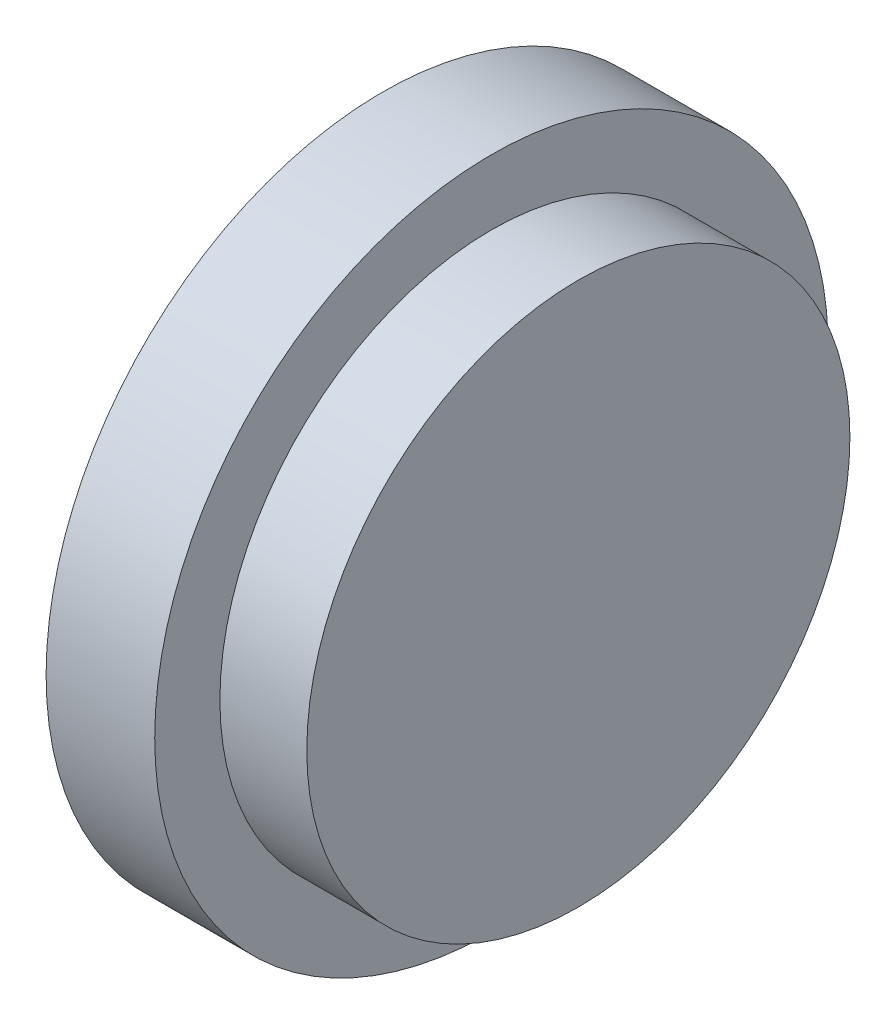
ISO-10303-21;
HEADER;
FILE_DESCRIPTION(('STEP AP214'),'2;1');
FILE_NAME('part.step','',(''),(''),'','','');
FILE_SCHEMA(('AUTOMOTIVE_DESIGN { 1 0 10303 214 1 1 1 1 }'));
ENDSEC;
DATA;
#1=APPLICATION_CONTEXT('core data for automotive mechanical design processes');
#2=APPLICATION_PROTOCOL_DEFINITION('international standard','automotive_design',2000,#1);
#3=PRODUCT_CONTEXT('',#1,'mechanical');
#4=PRODUCT('Part','Part','',(#3));
#5=PRODUCT_RELATED_PRODUCT_CATEGORY('part','',(#4));
#6=PRODUCT_DEFINITION_FORMATION('','',#4);
#7=PRODUCT_DEFINITION_CONTEXT('part definition',#1,'design');
#8=PRODUCT_DEFINITION('design','',#6,#7);
#9=PRODUCT_DEFINITION_SHAPE('','',#8);
#10=(LENGTH_UNIT() NAMED_UNIT(*) SI_UNIT(.MILLI.,.METRE.));
#11=(NAMED_UNIT(*) PLANE_ANGLE_UNIT() SI_UNIT($,.RADIAN.));
#12=(NAMED_UNIT(*) SI_UNIT($,.STERADIAN.) SOLID_ANGLE_UNIT());
#13=UNCERTAINTY_MEASURE_WITH_UNIT(LENGTH_MEASURE(1.E-05),#10,'distance_accuracy_value','');
#14=(GEOMETRIC_REPRESENTATION_CONTEXT(3) GLOBAL_UNCERTAINTY_ASSIGNED_CONTEXT((#13)) GLOBAL_UNIT_ASSIGNED_CONTEXT((#10,
#11,#12)) REPRESENTATION_CONTEXT('',''));
#15=CARTESIAN_POINT('',(0.,0.,0.));
#16=DIRECTION('',(0.,0.,1.));
#17=DIRECTION('',(1.,0.,0.));
#18=AXIS2_PLACEMENT_3D('',#15,#16,#17);
#19=CARTESIAN_POINT('',(0.,0.,0.));
#20=DIRECTION('',(1.,0.,0.));
#21=DIRECTION('',(0.,0.,-1.));
#22=AXIS2_PLACEMENT_3D('',#19,#20,#21);
#23=PLANE('',#22);
#24=CARTESIAN_POINT('',(0.,0.,0.));
#25=DIRECTION('',(-1.,0.,0.));
#26=DIRECTION('',(0.,0.,1.));
#27=AXIS2_PLACEMENT_3D('',#24,#25,#26);
#28=CIRCLE('',#27,15.5);
#29=CARTESIAN_POINT('',(0.,0.,15.5));
#30=VERTEX_POINT('',#29);
#31=EDGE_CURVE('E10',#30,#30,#28,.T.);
#32=ORIENTED_EDGE('',*,*,#31,.T.);
#33=EDGE_LOOP('',(#32));
#34=FACE_BOUND('',#33,.T.);
#35=ADVANCED_FACE('F35',(#34),#23,.F.);
#36=CARTESIAN_POINT('',(0.,0.,0.));
#37=DIRECTION('',(-1.,0.,0.));
#38=DIRECTION('',(0.,0.,1.));
#39=AXIS2_PLACEMENT_3D('',#36,#37,#38);
#40=CYLINDRICAL_SURFACE('',#39,15.5);
#41=ORIENTED_EDGE('',*,*,#31,.F.);
#42=EDGE_LOOP('',(#41));
#43=FACE_BOUND('',#42,.T.);
#44=CARTESIAN_POINT('',(5.,0.,0.));
#45=DIRECTION('',(-1.,0.,0.));
#46=DIRECTION('',(0.,0.,1.));
#47=AXIS2_PLACEMENT_3D('',#44,#45,#46);
#48=CIRCLE('',#47,15.5);
#49=CARTESIAN_POINT('',(5.,0.,15.5));
#50=VERTEX_POINT('',#49);
#51=EDGE_CURVE('E41',#50,#50,#48,.T.);
#52=ORIENTED_EDGE('',*,*,#51,.T.);
#53=EDGE_LOOP('',(#52));
#54=FACE_BOUND('',#53,.T.);
#55=ADVANCED_FACE('F69',(#43,#54),#40,.T.);
#56=CARTESIAN_POINT('',(5.,15.5,0.));
#57=DIRECTION('',(-1.,0.,0.));
#58=DIRECTION('',(0.,0.,1.));
#59=AXIS2_PLACEMENT_3D('',#56,#57,#58);
#60=PLANE('',#59);
#61=ORIENTED_EDGE('',*,*,#51,.F.);
#62=EDGE_LOOP('',(#61));
#63=FACE_BOUND('',#62,.T.);
#64=CARTESIAN_POINT('',(5.,0.,0.));
#65=DIRECTION('',(-1.,0.,0.));
#66=DIRECTION('',(0.,0.,1.));
#67=AXIS2_PLACEMENT_3D('',#64,#65,#66);
#68=CIRCLE('',#67,12.5);
#69=CARTESIAN_POINT('',(5.,0.,12.5));
#70=VERTEX_POINT('',#69);
#71=EDGE_CURVE('E46',#70,#70,#68,.T.);
#72=ORIENTED_EDGE('',*,*,#71,.T.);
#73=EDGE_LOOP('',(#72));
#74=FACE_BOUND('',#73,.T.);
#75=ADVANCED_FACE('F65',(#63,#74),#60,.F.);
#76=CARTESIAN_POINT('',(0.,0.,0.));
#77=DIRECTION('',(-1.,0.,0.));
#78=DIRECTION('',(0.,0.,1.));
#79=AXIS2_PLACEMENT_3D('',#76,#77,#78);
#80=CYLINDRICAL_SURFACE('',#79,12.5);
#81=ORIENTED_EDGE('',*,*,#71,.F.);
#82=EDGE_LOOP('',(#81));
#83=FACE_BOUND('',#82,.T.);
#84=CARTESIAN_POINT('',(9.,0.,0.));
#85=DIRECTION('',(-1.,0.,0.));
#86=DIRECTION('',(0.,0.,1.));
#87=AXIS2_PLACEMENT_3D('',#84,#85,#86);
#88=CIRCLE('',#87,12.5);
#89=CARTESIAN_POINT('',(9.,0.,12.5));
#90=VERTEX_POINT('',#89);
#91=EDGE_CURVE('E51',#90,#90,#88,.T.);
#92=ORIENTED_EDGE('',*,*,#91,.T.);
#93=EDGE_LOOP('',(#92));
#94=FACE_BOUND('',#93,.T.);
#95=ADVANCED_FACE('F57',(#83,#94),#80,.T.);
#96=CARTESIAN_POINT('',(9.,12.5,0.));
#97=DIRECTION('',(-1.,0.,0.));
#98=DIRECTION('',(0.,0.,1.));
#99=AXIS2_PLACEMENT_3D('',#96,#97,#98);
#100=PLANE('',#99);
#101=ORIENTED_EDGE('',*,*,#91,.F.);
#102=EDGE_LOOP('',(#101));
#103=FACE_BOUND('',#102,.T.);
#104=ADVANCED_FACE('F59',(#103),#100,.F.);
#105=CLOSED_SHELL('',(#35,#55,#75,#95,#104));
#106=MANIFOLD_SOLID_BREP('B2',#105);
#107=ADVANCED_BREP_SHAPE_REPRESENTATION('',(#18,#106),#14);
#108=SHAPE_DEFINITION_REPRESENTATION(#9,#107);
ENDSEC;
END-ISO-10303-21;
